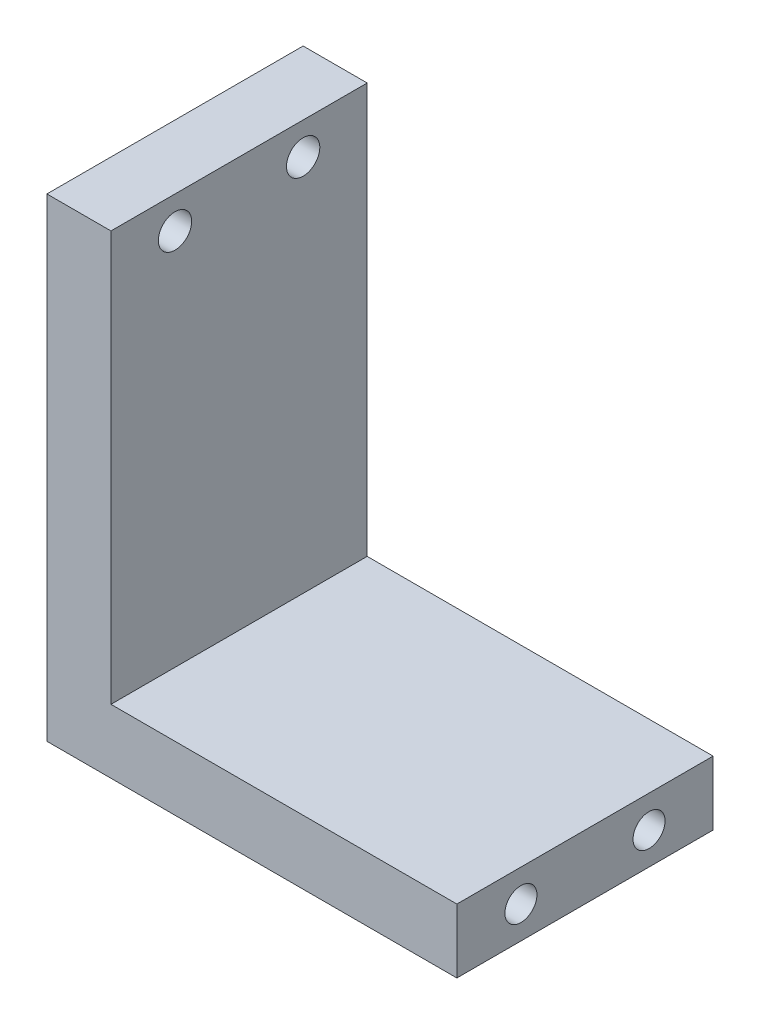
ISO-10303-21;
HEADER;
FILE_DESCRIPTION(('STEP AP214'),'2;1');
FILE_NAME('part.step','',(''),(''),'','','');
FILE_SCHEMA(('AUTOMOTIVE_DESIGN { 1 0 10303 214 1 1 1 1 }'));
ENDSEC;
DATA;
#1=APPLICATION_CONTEXT('core data for automotive mechanical design processes');
#2=APPLICATION_PROTOCOL_DEFINITION('international standard','automotive_design',2000,#1);
#3=PRODUCT_CONTEXT('',#1,'mechanical');
#4=PRODUCT('Part','Part','',(#3));
#5=PRODUCT_RELATED_PRODUCT_CATEGORY('part','',(#4));
#6=PRODUCT_DEFINITION_FORMATION('','',#4);
#7=PRODUCT_DEFINITION_CONTEXT('part definition',#1,'design');
#8=PRODUCT_DEFINITION('design','',#6,#7);
#9=PRODUCT_DEFINITION_SHAPE('','',#8);
#10=(LENGTH_UNIT() NAMED_UNIT(*) SI_UNIT(.MILLI.,.METRE.));
#11=(NAMED_UNIT(*) PLANE_ANGLE_UNIT() SI_UNIT($,.RADIAN.));
#12=(NAMED_UNIT(*) SI_UNIT($,.STERADIAN.) SOLID_ANGLE_UNIT());
#13=UNCERTAINTY_MEASURE_WITH_UNIT(LENGTH_MEASURE(1.E-05),#10,'distance_accuracy_value','');
#14=(GEOMETRIC_REPRESENTATION_CONTEXT(3) GLOBAL_UNCERTAINTY_ASSIGNED_CONTEXT((#13)) GLOBAL_UNIT_ASSIGNED_CONTEXT((#10,
#11,#12)) REPRESENTATION_CONTEXT('',''));
#15=CARTESIAN_POINT('',(0.,0.,0.));
#16=DIRECTION('',(0.,0.,1.));
#17=DIRECTION('',(1.,0.,0.));
#18=AXIS2_PLACEMENT_3D('',#15,#16,#17);
#19=CARTESIAN_POINT('',(0.,0.,20.));
#20=DIRECTION('',(0.,-1.,0.));
#21=DIRECTION('',(1.,0.,0.));
#22=AXIS2_PLACEMENT_3D('',#19,#20,#21);
#23=PLANE('',#22);
#24=DIRECTION('',(-1.,0.,0.));
#25=VECTOR('',#24,1.);
#26=CARTESIAN_POINT('',(0.,0.,0.));
#27=LINE('',#26,#25);
#28=CARTESIAN_POINT('',(27.,0.,0.));
#29=VERTEX_POINT('',#28);
#30=CARTESIAN_POINT('',(0.,0.,0.));
#31=VERTEX_POINT('',#30);
#32=EDGE_CURVE('E145',#29,#31,#27,.T.);
#33=ORIENTED_EDGE('',*,*,#32,.T.);
#34=DIRECTION('',(0.,0.,-1.));
#35=VECTOR('',#34,1.);
#36=CARTESIAN_POINT('',(0.,0.,20.));
#37=LINE('',#36,#35);
#38=CARTESIAN_POINT('',(0.,0.,20.));
#39=VERTEX_POINT('',#38);
#40=EDGE_CURVE('E11',#39,#31,#37,.T.);
#41=ORIENTED_EDGE('',*,*,#40,.F.);
#42=DIRECTION('',(-1.,0.,0.));
#43=VECTOR('',#42,1.);
#44=CARTESIAN_POINT('',(0.,0.,20.));
#45=LINE('',#44,#43);
#46=CARTESIAN_POINT('',(27.,0.,20.));
#47=VERTEX_POINT('',#46);
#48=EDGE_CURVE('E162',#47,#39,#45,.T.);
#49=ORIENTED_EDGE('',*,*,#48,.F.);
#50=DIRECTION('',(0.,0.,-1.));
#51=VECTOR('',#50,1.);
#52=CARTESIAN_POINT('',(27.,0.,20.));
#53=LINE('',#52,#51);
#54=EDGE_CURVE('E141',#47,#29,#53,.T.);
#55=ORIENTED_EDGE('',*,*,#54,.T.);
#56=EDGE_LOOP('',(#33,#41,#49,#55));
#57=FACE_BOUND('',#56,.T.);
#58=ADVANCED_FACE('F51',(#57),#23,.F.);
#59=CARTESIAN_POINT('',(0.,0.,20.));
#60=DIRECTION('',(-1.,0.,0.));
#61=DIRECTION('',(0.,0.,1.));
#62=AXIS2_PLACEMENT_3D('',#59,#60,#61);
#63=PLANE('',#62);
#64=CARTESIAN_POINT('',(0.,29.5,15.));
#65=DIRECTION('',(-1.,0.,0.));
#66=DIRECTION('',(0.,0.,1.));
#67=AXIS2_PLACEMENT_3D('',#64,#65,#66);
#68=CIRCLE('',#67,1.29999999999999);
#69=CARTESIAN_POINT('',(0.,29.5,16.3));
#70=VERTEX_POINT('',#69);
#71=EDGE_CURVE('E54',#70,#70,#68,.T.);
#72=ORIENTED_EDGE('',*,*,#71,.T.);
#73=EDGE_LOOP('',(#72));
#74=FACE_BOUND('',#73,.T.);
#75=CARTESIAN_POINT('',(0.,29.5,5.));
#76=DIRECTION('',(-1.,0.,0.));
#77=DIRECTION('',(0.,0.,1.));
#78=AXIS2_PLACEMENT_3D('',#75,#76,#77);
#79=CIRCLE('',#78,1.29999999999999);
#80=CARTESIAN_POINT('',(0.,29.5,6.29999999999999));
#81=VERTEX_POINT('',#80);
#82=EDGE_CURVE('E150',#81,#81,#79,.T.);
#83=ORIENTED_EDGE('',*,*,#82,.T.);
#84=EDGE_LOOP('',(#83));
#85=FACE_BOUND('',#84,.T.);
#86=DIRECTION('',(0.,1.,0.));
#87=VECTOR('',#86,1.);
#88=CARTESIAN_POINT('',(0.,0.,0.));
#89=LINE('',#88,#87);
#90=CARTESIAN_POINT('',(0.,32.,0.));
#91=VERTEX_POINT('',#90);
#92=EDGE_CURVE('E149',#31,#91,#89,.T.);
#93=ORIENTED_EDGE('',*,*,#92,.T.);
#94=DIRECTION('',(0.,0.,-1.));
#95=VECTOR('',#94,1.);
#96=CARTESIAN_POINT('',(0.,32.,20.));
#97=LINE('',#96,#95);
#98=CARTESIAN_POINT('',(0.,32.,20.));
#99=VERTEX_POINT('',#98);
#100=EDGE_CURVE('E61',#99,#91,#97,.T.);
#101=ORIENTED_EDGE('',*,*,#100,.F.);
#102=DIRECTION('',(0.,1.,0.));
#103=VECTOR('',#102,1.);
#104=CARTESIAN_POINT('',(0.,0.,20.));
#105=LINE('',#104,#103);
#106=EDGE_CURVE('E107',#39,#99,#105,.T.);
#107=ORIENTED_EDGE('',*,*,#106,.F.);
#108=ORIENTED_EDGE('',*,*,#40,.T.);
#109=EDGE_LOOP('',(#93,#101,#107,#108));
#110=FACE_BOUND('',#109,.T.);
#111=ADVANCED_FACE('F193',(#74,#85,#110),#63,.F.);
#112=CARTESIAN_POINT('',(0.,32.,20.));
#113=DIRECTION('',(0.,-1.,0.));
#114=DIRECTION('',(0.,0.,-1.));
#115=AXIS2_PLACEMENT_3D('',#112,#113,#114);
#116=PLANE('',#115);
#117=DIRECTION('',(-1.,0.,0.));
#118=VECTOR('',#117,1.);
#119=CARTESIAN_POINT('',(0.,32.,0.));
#120=LINE('',#119,#118);
#121=CARTESIAN_POINT('',(-5.,32.,0.));
#122=VERTEX_POINT('',#121);
#123=EDGE_CURVE('E153',#91,#122,#120,.T.);
#124=ORIENTED_EDGE('',*,*,#123,.T.);
#125=DIRECTION('',(0.,0.,-1.));
#126=VECTOR('',#125,1.);
#127=CARTESIAN_POINT('',(-5.,32.,20.));
#128=LINE('',#127,#126);
#129=CARTESIAN_POINT('',(-5.,32.,20.));
#130=VERTEX_POINT('',#129);
#131=EDGE_CURVE('E134',#130,#122,#128,.T.);
#132=ORIENTED_EDGE('',*,*,#131,.F.);
#133=DIRECTION('',(-1.,0.,0.));
#134=VECTOR('',#133,1.);
#135=CARTESIAN_POINT('',(0.,32.,20.));
#136=LINE('',#135,#134);
#137=EDGE_CURVE('E122',#99,#130,#136,.T.);
#138=ORIENTED_EDGE('',*,*,#137,.F.);
#139=ORIENTED_EDGE('',*,*,#100,.T.);
#140=EDGE_LOOP('',(#124,#132,#138,#139));
#141=FACE_BOUND('',#140,.T.);
#142=ADVANCED_FACE('F196',(#141),#116,.F.);
#143=CARTESIAN_POINT('',(-5.,-5.,20.));
#144=DIRECTION('',(1.,0.,0.));
#145=DIRECTION('',(0.,0.,-1.));
#146=AXIS2_PLACEMENT_3D('',#143,#144,#145);
#147=PLANE('',#146);
#148=CARTESIAN_POINT('',(-5.,29.5,15.));
#149=DIRECTION('',(-1.,0.,0.));
#150=DIRECTION('',(0.,0.,1.));
#151=AXIS2_PLACEMENT_3D('',#148,#149,#150);
#152=CIRCLE('',#151,2.2);
#153=CARTESIAN_POINT('',(-5.,29.5,17.2));
#154=VERTEX_POINT('',#153);
#155=EDGE_CURVE('E233',#154,#154,#152,.T.);
#156=ORIENTED_EDGE('',*,*,#155,.F.);
#157=EDGE_LOOP('',(#156));
#158=FACE_BOUND('',#157,.T.);
#159=CARTESIAN_POINT('',(-5.,29.5,5.));
#160=DIRECTION('',(-1.,0.,0.));
#161=DIRECTION('',(0.,0.,1.));
#162=AXIS2_PLACEMENT_3D('',#159,#160,#161);
#163=CIRCLE('',#162,2.2);
#164=CARTESIAN_POINT('',(-5.,29.5,7.2));
#165=VERTEX_POINT('',#164);
#166=EDGE_CURVE('E178',#165,#165,#163,.T.);
#167=ORIENTED_EDGE('',*,*,#166,.F.);
#168=EDGE_LOOP('',(#167));
#169=FACE_BOUND('',#168,.T.);
#170=DIRECTION('',(0.,-1.,0.));
#171=VECTOR('',#170,1.);
#172=CARTESIAN_POINT('',(-5.,-5.,0.));
#173=LINE('',#172,#171);
#174=CARTESIAN_POINT('',(-5.,-5.,0.));
#175=VERTEX_POINT('',#174);
#176=EDGE_CURVE('E132',#122,#175,#173,.T.);
#177=ORIENTED_EDGE('',*,*,#176,.T.);
#178=DIRECTION('',(0.,0.,-1.));
#179=VECTOR('',#178,1.);
#180=CARTESIAN_POINT('',(-5.,-5.,20.));
#181=LINE('',#180,#179);
#182=CARTESIAN_POINT('',(-5.,-5.,20.));
#183=VERTEX_POINT('',#182);
#184=EDGE_CURVE('E129',#183,#175,#181,.T.);
#185=ORIENTED_EDGE('',*,*,#184,.F.);
#186=DIRECTION('',(0.,-1.,0.));
#187=VECTOR('',#186,1.);
#188=CARTESIAN_POINT('',(-5.,-5.,20.));
#189=LINE('',#188,#187);
#190=EDGE_CURVE('E116',#130,#183,#189,.T.);
#191=ORIENTED_EDGE('',*,*,#190,.F.);
#192=ORIENTED_EDGE('',*,*,#131,.T.);
#193=EDGE_LOOP('',(#177,#185,#191,#192));
#194=FACE_BOUND('',#193,.T.);
#195=ADVANCED_FACE('F130',(#158,#169,#194),#147,.F.);
#196=CARTESIAN_POINT('',(0.,-5.,20.));
#197=DIRECTION('',(0.,1.,0.));
#198=DIRECTION('',(-1.,0.,0.));
#199=AXIS2_PLACEMENT_3D('',#196,#197,#198);
#200=PLANE('',#199);
#201=DIRECTION('',(1.,0.,0.));
#202=VECTOR('',#201,1.);
#203=CARTESIAN_POINT('',(0.,-5.,0.));
#204=LINE('',#203,#202);
#205=CARTESIAN_POINT('',(27.,-5.,0.));
#206=VERTEX_POINT('',#205);
#207=EDGE_CURVE('E93',#175,#206,#204,.T.);
#208=ORIENTED_EDGE('',*,*,#207,.T.);
#209=DIRECTION('',(0.,0.,-1.));
#210=VECTOR('',#209,1.);
#211=CARTESIAN_POINT('',(27.,-5.,20.));
#212=LINE('',#211,#210);
#213=CARTESIAN_POINT('',(27.,-5.,20.));
#214=VERTEX_POINT('',#213);
#215=EDGE_CURVE('E135',#214,#206,#212,.T.);
#216=ORIENTED_EDGE('',*,*,#215,.F.);
#217=DIRECTION('',(1.,0.,0.));
#218=VECTOR('',#217,1.);
#219=CARTESIAN_POINT('',(0.,-5.,20.));
#220=LINE('',#219,#218);
#221=EDGE_CURVE('E120',#183,#214,#220,.T.);
#222=ORIENTED_EDGE('',*,*,#221,.F.);
#223=ORIENTED_EDGE('',*,*,#184,.T.);
#224=EDGE_LOOP('',(#208,#216,#222,#223));
#225=FACE_BOUND('',#224,.T.);
#226=ADVANCED_FACE('F137',(#225),#200,.F.);
#227=CARTESIAN_POINT('',(27.,0.,20.));
#228=DIRECTION('',(-1.,0.,0.));
#229=DIRECTION('',(0.,0.,1.));
#230=AXIS2_PLACEMENT_3D('',#227,#228,#229);
#231=PLANE('',#230);
#232=CARTESIAN_POINT('',(27.,-2.5,15.));
#233=DIRECTION('',(1.,0.,0.));
#234=DIRECTION('',(0.,0.,-1.));
#235=AXIS2_PLACEMENT_3D('',#232,#233,#234);
#236=CIRCLE('',#235,1.24999999999999);
#237=CARTESIAN_POINT('',(27.,-2.5,13.75));
#238=VERTEX_POINT('',#237);
#239=EDGE_CURVE('E387',#238,#238,#236,.T.);
#240=ORIENTED_EDGE('',*,*,#239,.F.);
#241=EDGE_LOOP('',(#240));
#242=FACE_BOUND('',#241,.T.);
#243=CARTESIAN_POINT('',(27.,-2.5,5.));
#244=DIRECTION('',(1.,0.,0.));
#245=DIRECTION('',(0.,0.,-1.));
#246=AXIS2_PLACEMENT_3D('',#243,#244,#245);
#247=CIRCLE('',#246,1.24999999999999);
#248=CARTESIAN_POINT('',(27.,-2.5,3.75000000000001));
#249=VERTEX_POINT('',#248);
#250=EDGE_CURVE('E391',#249,#249,#247,.T.);
#251=ORIENTED_EDGE('',*,*,#250,.F.);
#252=EDGE_LOOP('',(#251));
#253=FACE_BOUND('',#252,.T.);
#254=DIRECTION('',(0.,1.,0.));
#255=VECTOR('',#254,1.);
#256=CARTESIAN_POINT('',(27.,0.,0.));
#257=LINE('',#256,#255);
#258=EDGE_CURVE('E99',#206,#29,#257,.T.);
#259=ORIENTED_EDGE('',*,*,#258,.T.);
#260=ORIENTED_EDGE('',*,*,#54,.F.);
#261=DIRECTION('',(0.,1.,0.));
#262=VECTOR('',#261,1.);
#263=CARTESIAN_POINT('',(27.,0.,20.));
#264=LINE('',#263,#262);
#265=EDGE_CURVE('E70',#214,#47,#264,.T.);
#266=ORIENTED_EDGE('',*,*,#265,.F.);
#267=ORIENTED_EDGE('',*,*,#215,.T.);
#268=EDGE_LOOP('',(#259,#260,#266,#267));
#269=FACE_BOUND('',#268,.T.);
#270=ADVANCED_FACE('F201',(#242,#253,#269),#231,.F.);
#271=CARTESIAN_POINT('',(0.,0.,20.));
#272=DIRECTION('',(0.,0.,-1.));
#273=DIRECTION('',(-1.,0.,0.));
#274=AXIS2_PLACEMENT_3D('',#271,#272,#273);
#275=PLANE('',#274);
#276=ORIENTED_EDGE('',*,*,#48,.T.);
#277=ORIENTED_EDGE('',*,*,#106,.T.);
#278=ORIENTED_EDGE('',*,*,#137,.T.);
#279=ORIENTED_EDGE('',*,*,#190,.T.);
#280=ORIENTED_EDGE('',*,*,#221,.T.);
#281=ORIENTED_EDGE('',*,*,#265,.T.);
#282=EDGE_LOOP('',(#276,#277,#278,#279,#280,#281));
#283=FACE_BOUND('',#282,.T.);
#284=ADVANCED_FACE('F118',(#283),#275,.F.);
#285=CARTESIAN_POINT('',(0.,0.,0.));
#286=DIRECTION('',(0.,0.,-1.));
#287=DIRECTION('',(-1.,0.,0.));
#288=AXIS2_PLACEMENT_3D('',#285,#286,#287);
#289=PLANE('',#288);
#290=ORIENTED_EDGE('',*,*,#32,.F.);
#291=ORIENTED_EDGE('',*,*,#258,.F.);
#292=ORIENTED_EDGE('',*,*,#207,.F.);
#293=ORIENTED_EDGE('',*,*,#176,.F.);
#294=ORIENTED_EDGE('',*,*,#123,.F.);
#295=ORIENTED_EDGE('',*,*,#92,.F.);
#296=EDGE_LOOP('',(#290,#291,#292,#293,#294,#295));
#297=FACE_BOUND('',#296,.T.);
#298=ADVANCED_FACE('F199',(#297),#289,.T.);
#299=CARTESIAN_POINT('',(-5.,29.5,5.));
#300=DIRECTION('',(-1.,0.,0.));
#301=DIRECTION('',(0.,0.,1.));
#302=AXIS2_PLACEMENT_3D('',#299,#300,#301);
#303=CYLINDRICAL_SURFACE('',#302,1.29999999999999);
#304=CARTESIAN_POINT('',(-4.1,29.5,5.));
#305=DIRECTION('',(-1.,0.,0.));
#306=DIRECTION('',(0.,0.,1.));
#307=AXIS2_PLACEMENT_3D('',#304,#305,#306);
#308=CIRCLE('',#307,1.3);
#309=CARTESIAN_POINT('',(-4.1,29.5,6.3));
#310=VERTEX_POINT('',#309);
#311=EDGE_CURVE('E173',#310,#310,#308,.T.);
#312=ORIENTED_EDGE('',*,*,#311,.T.);
#313=EDGE_LOOP('',(#312));
#314=FACE_BOUND('',#313,.T.);
#315=ORIENTED_EDGE('',*,*,#82,.F.);
#316=EDGE_LOOP('',(#315));
#317=FACE_BOUND('',#316,.T.);
#318=ADVANCED_FACE('F239',(#314,#317),#303,.F.);
#319=CARTESIAN_POINT('',(-5.,29.5,5.));
#320=DIRECTION('',(-1.,0.,0.));
#321=DIRECTION('',(0.,0.,1.));
#322=AXIS2_PLACEMENT_3D('',#319,#320,#321);
#323=CONICAL_SURFACE('',#322,2.2,0.785398163397448);
#324=ORIENTED_EDGE('',*,*,#311,.F.);
#325=EDGE_LOOP('',(#324));
#326=FACE_BOUND('',#325,.T.);
#327=ORIENTED_EDGE('',*,*,#166,.T.);
#328=EDGE_LOOP('',(#327));
#329=FACE_BOUND('',#328,.T.);
#330=ADVANCED_FACE('F236',(#326,#329),#323,.F.);
#331=CARTESIAN_POINT('',(-5.,29.5,15.));
#332=DIRECTION('',(-1.,0.,0.));
#333=DIRECTION('',(0.,0.,1.));
#334=AXIS2_PLACEMENT_3D('',#331,#332,#333);
#335=CYLINDRICAL_SURFACE('',#334,1.29999999999999);
#336=CARTESIAN_POINT('',(-4.1,29.5,15.));
#337=DIRECTION('',(-1.,0.,0.));
#338=DIRECTION('',(0.,0.,1.));
#339=AXIS2_PLACEMENT_3D('',#336,#337,#338);
#340=CIRCLE('',#339,1.3);
#341=CARTESIAN_POINT('',(-4.1,29.5,16.3));
#342=VERTEX_POINT('',#341);
#343=EDGE_CURVE('E402',#342,#342,#340,.T.);
#344=ORIENTED_EDGE('',*,*,#343,.T.);
#345=EDGE_LOOP('',(#344));
#346=FACE_BOUND('',#345,.T.);
#347=ORIENTED_EDGE('',*,*,#71,.F.);
#348=EDGE_LOOP('',(#347));
#349=FACE_BOUND('',#348,.T.);
#350=ADVANCED_FACE('F238',(#346,#349),#335,.F.);
#351=CARTESIAN_POINT('',(-5.,29.5,15.));
#352=DIRECTION('',(-1.,0.,0.));
#353=DIRECTION('',(0.,0.,1.));
#354=AXIS2_PLACEMENT_3D('',#351,#352,#353);
#355=CONICAL_SURFACE('',#354,2.2,0.785398163397448);
#356=ORIENTED_EDGE('',*,*,#343,.F.);
#357=EDGE_LOOP('',(#356));
#358=FACE_BOUND('',#357,.T.);
#359=ORIENTED_EDGE('',*,*,#155,.T.);
#360=EDGE_LOOP('',(#359));
#361=FACE_BOUND('',#360,.T.);
#362=ADVANCED_FACE('F246',(#358,#361),#355,.F.);
#363=CARTESIAN_POINT('',(17.,-2.5,5.));
#364=DIRECTION('',(1.,0.,0.));
#365=DIRECTION('',(0.,0.,-1.));
#366=AXIS2_PLACEMENT_3D('',#363,#364,#365);
#367=CONICAL_SURFACE('',#366,1.24999999999999,1.02974425867665);
#368=CARTESIAN_POINT('',(16.2489242262156,-2.5,5.));
#369=VERTEX_POINT('',#368);
#370=VERTEX_LOOP('',#369);
#371=FACE_BOUND('',#370,.T.);
#372=CARTESIAN_POINT('',(17.,-2.5,5.));
#373=DIRECTION('',(1.,0.,0.));
#374=DIRECTION('',(0.,0.,-1.));
#375=AXIS2_PLACEMENT_3D('',#372,#373,#374);
#376=CIRCLE('',#375,1.24999999999999);
#377=CARTESIAN_POINT('',(17.,-2.5,3.75000000000001));
#378=VERTEX_POINT('',#377);
#379=EDGE_CURVE('E397',#378,#378,#376,.T.);
#380=ORIENTED_EDGE('',*,*,#379,.T.);
#381=EDGE_LOOP('',(#380));
#382=FACE_BOUND('',#381,.T.);
#383=ADVANCED_FACE('F295',(#371,#382),#367,.F.);
#384=CARTESIAN_POINT('',(27.,-2.5,5.));
#385=DIRECTION('',(1.,0.,0.));
#386=DIRECTION('',(0.,0.,-1.));
#387=AXIS2_PLACEMENT_3D('',#384,#385,#386);
#388=CYLINDRICAL_SURFACE('',#387,1.24999999999999);
#389=ORIENTED_EDGE('',*,*,#379,.F.);
#390=EDGE_LOOP('',(#389));
#391=FACE_BOUND('',#390,.T.);
#392=ORIENTED_EDGE('',*,*,#250,.T.);
#393=EDGE_LOOP('',(#392));
#394=FACE_BOUND('',#393,.T.);
#395=ADVANCED_FACE('F305',(#391,#394),#388,.F.);
#396=CARTESIAN_POINT('',(17.,-2.5,15.));
#397=DIRECTION('',(1.,0.,0.));
#398=DIRECTION('',(0.,0.,-1.));
#399=AXIS2_PLACEMENT_3D('',#396,#397,#398);
#400=CONICAL_SURFACE('',#399,1.24999999999999,1.02974425867665);
#401=CARTESIAN_POINT('',(16.2489242262156,-2.5,15.));
#402=VERTEX_POINT('',#401);
#403=VERTEX_LOOP('',#402);
#404=FACE_BOUND('',#403,.T.);
#405=CARTESIAN_POINT('',(17.,-2.5,15.));
#406=DIRECTION('',(1.,0.,0.));
#407=DIRECTION('',(0.,0.,-1.));
#408=AXIS2_PLACEMENT_3D('',#405,#406,#407);
#409=CIRCLE('',#408,1.24999999999999);
#410=CARTESIAN_POINT('',(17.,-2.5,13.75));
#411=VERTEX_POINT('',#410);
#412=EDGE_CURVE('E385',#411,#411,#409,.T.);
#413=ORIENTED_EDGE('',*,*,#412,.T.);
#414=EDGE_LOOP('',(#413));
#415=FACE_BOUND('',#414,.T.);
#416=ADVANCED_FACE('F316',(#404,#415),#400,.F.);
#417=CARTESIAN_POINT('',(27.,-2.5,15.));
#418=DIRECTION('',(1.,0.,0.));
#419=DIRECTION('',(0.,0.,-1.));
#420=AXIS2_PLACEMENT_3D('',#417,#418,#419);
#421=CYLINDRICAL_SURFACE('',#420,1.24999999999999);
#422=ORIENTED_EDGE('',*,*,#412,.F.);
#423=EDGE_LOOP('',(#422));
#424=FACE_BOUND('',#423,.T.);
#425=ORIENTED_EDGE('',*,*,#239,.T.);
#426=EDGE_LOOP('',(#425));
#427=FACE_BOUND('',#426,.T.);
#428=ADVANCED_FACE('F327',(#424,#427),#421,.F.);
#429=CLOSED_SHELL('',(#58,#111,#142,#195,#226,#270,#284,#298,#318,#330,#350,#362,#383,#395,#416,#428));
#430=MANIFOLD_SOLID_BREP('B2',#429);
#431=ADVANCED_BREP_SHAPE_REPRESENTATION('',(#18,#430),#14);
#432=SHAPE_DEFINITION_REPRESENTATION(#9,#431);
ENDSEC;
END-ISO-10303-21;
